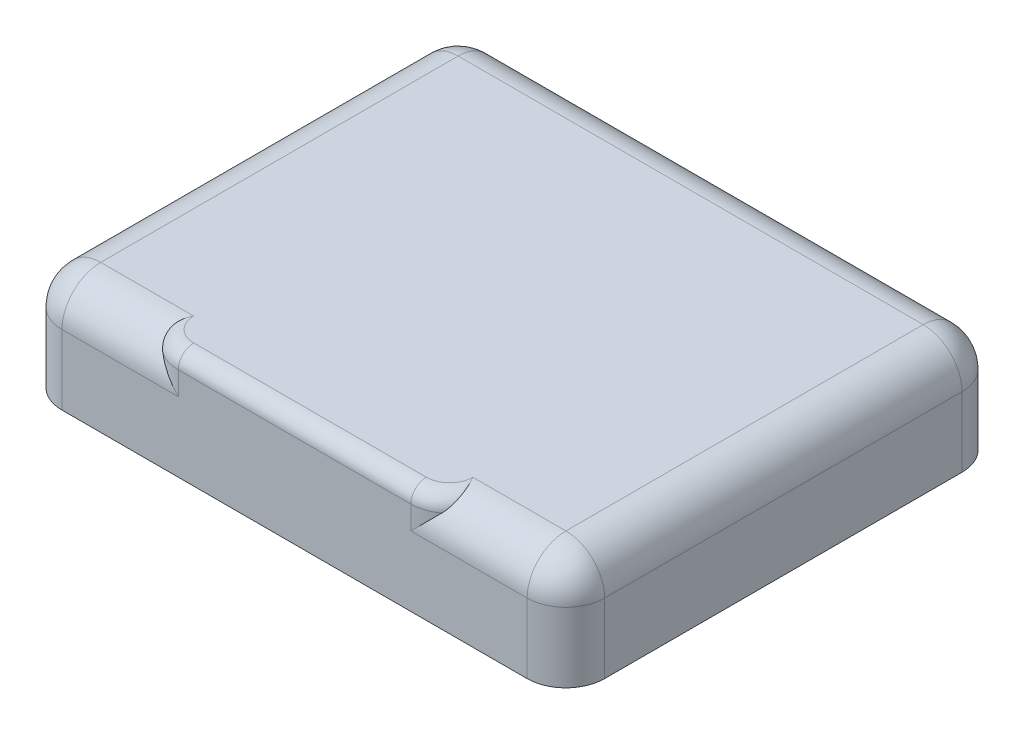
ISO-10303-21;
HEADER;
FILE_DESCRIPTION(('STEP AP214'),'2;1');
FILE_NAME('part.step','',(''),(''),'','','');
FILE_SCHEMA(('AUTOMOTIVE_DESIGN { 1 0 10303 214 1 1 1 1 }'));
ENDSEC;
DATA;
#1=APPLICATION_CONTEXT('core data for automotive mechanical design processes');
#2=APPLICATION_PROTOCOL_DEFINITION('international standard','automotive_design',2000,#1);
#3=PRODUCT_CONTEXT('',#1,'mechanical');
#4=PRODUCT('Part','Part','',(#3));
#5=PRODUCT_RELATED_PRODUCT_CATEGORY('part','',(#4));
#6=PRODUCT_DEFINITION_FORMATION('','',#4);
#7=PRODUCT_DEFINITION_CONTEXT('part definition',#1,'design');
#8=PRODUCT_DEFINITION('design','',#6,#7);
#9=PRODUCT_DEFINITION_SHAPE('','',#8);
#10=(LENGTH_UNIT() NAMED_UNIT(*) SI_UNIT(.MILLI.,.METRE.));
#11=(NAMED_UNIT(*) PLANE_ANGLE_UNIT() SI_UNIT($,.RADIAN.));
#12=(NAMED_UNIT(*) SI_UNIT($,.STERADIAN.) SOLID_ANGLE_UNIT());
#13=UNCERTAINTY_MEASURE_WITH_UNIT(LENGTH_MEASURE(1.E-05),#10,'distance_accuracy_value','');
#14=(GEOMETRIC_REPRESENTATION_CONTEXT(3) GLOBAL_UNCERTAINTY_ASSIGNED_CONTEXT((#13)) GLOBAL_UNIT_ASSIGNED_CONTEXT((#10,
#11,#12)) REPRESENTATION_CONTEXT('',''));
#15=CARTESIAN_POINT('',(0.,0.,0.));
#16=DIRECTION('',(0.,0.,1.));
#17=DIRECTION('',(1.,0.,0.));
#18=AXIS2_PLACEMENT_3D('',#15,#16,#17);
#19=CARTESIAN_POINT('',(-20.,11.9999971389771,-5.));
#20=DIRECTION('',(0.,1.,0.));
#21=DIRECTION('',(0.,0.,1.));
#22=AXIS2_PLACEMENT_3D('',#19,#20,#21);
#23=TOROIDAL_SURFACE('',#22,3.,2.);
#24=CARTESIAN_POINT('',(-20.,11.9999971389771,-2.));
#25=DIRECTION('',(1.,0.,0.));
#26=DIRECTION('',(0.,0.,-1.));
#27=AXIS2_PLACEMENT_3D('',#24,#25,#26);
#28=CIRCLE('',#27,2.);
#29=CARTESIAN_POINT('',(-20.,11.9999971389771,0.));
#30=VERTEX_POINT('',#29);
#31=CARTESIAN_POINT('',(-20.,13.9999971389771,-2.));
#32=VERTEX_POINT('',#31);
#33=EDGE_CURVE('E133',#30,#32,#28,.F.);
#34=ORIENTED_EDGE('',*,*,#33,.F.);
#35=CARTESIAN_POINT('',(-20.,11.9999971389771,-5.));
#36=DIRECTION('',(0.,-1.,0.));
#37=DIRECTION('',(0.,0.,-1.));
#38=AXIS2_PLACEMENT_3D('',#35,#36,#37);
#39=CIRCLE('',#38,5.);
#40=CARTESIAN_POINT('',(-17.0000028610229,11.9999971389771,-0.999997854234411));
#41=VERTEX_POINT('',#40);
#42=EDGE_CURVE('E169',#41,#30,#39,.T.);
#43=ORIENTED_EDGE('',*,*,#42,.F.);
#44=CARTESIAN_POINT('',(-17.0000028610229,11.9999971389771,-0.99999785423441));
#45=CARTESIAN_POINT('',(-16.9685433468448,12.0314710240786,-1.02358768529787));
#46=CARTESIAN_POINT('',(-16.9380150519812,12.063270522877,-1.04799673537902));
#47=CARTESIAN_POINT('',(-16.8762077793162,12.1302109559662,-1.10072530639158));
#48=CARTESIAN_POINT('',(-16.8451075337961,12.165395537653,-1.12919915582734));
#49=CARTESIAN_POINT('',(-16.7992746310245,12.2194929069951,-1.17428705505748));
#50=CARTESIAN_POINT('',(-16.7837096291553,12.2382937320209,-1.1901964888065));
#51=CARTESIAN_POINT('',(-16.7526582889092,12.2766802981899,-1.22318438950377));
#52=CARTESIAN_POINT('',(-16.7371977554441,12.2962685435128,-1.24028429458282));
#53=CARTESIAN_POINT('',(-16.7064504746294,12.3362016738893,-1.27570669609291));
#54=CARTESIAN_POINT('',(-16.6911907804579,12.3565480215097,-1.29405103341046));
#55=CARTESIAN_POINT('',(-16.6609465797777,12.3979644182072,-1.33201203223056));
#56=CARTESIAN_POINT('',(-16.6459903772758,12.4190348833442,-1.35165075344345));
#57=CARTESIAN_POINT('',(-16.6097346015399,12.4716196790879,-1.40149657886462));
#58=CARTESIAN_POINT('',(-16.5889732246579,12.5031242846623,-1.43210886747611));
#59=CARTESIAN_POINT('',(-16.5566372738639,12.5543339272155,-1.48326475915251));
#60=CARTESIAN_POINT('',(-16.5444916009827,12.5741183598081,-1.50337197717411));
#61=CARTESIAN_POINT('',(-16.5193498469932,12.6162909894805,-1.54697033614792));
#62=CARTESIAN_POINT('',(-16.5064681707389,12.6386612070119,-1.57054513895537));
#63=CARTESIAN_POINT('',(-16.4813797117608,12.6837728869937,-1.61904252645895));
#64=CARTESIAN_POINT('',(-16.4691996229751,12.706508619606,-1.64398425406534));
#65=CARTESIAN_POINT('',(-16.4474566874816,12.74866283634,-1.69120151837228));
#66=CARTESIAN_POINT('',(-16.4377620519291,12.768116665828,-1.71338513564617));
#67=CARTESIAN_POINT('',(-16.4141704554566,12.8172095152042,-1.77036828076625));
#68=CARTESIAN_POINT('',(-16.4008207217842,12.8466938806414,-1.8055305961112));
#69=CARTESIAN_POINT('',(-16.379842715385,12.8958591415639,-1.86589335639723));
#70=CARTESIAN_POINT('',(-16.3717295261005,12.9157264109571,-1.89077602268205));
#71=CARTESIAN_POINT('',(-16.3566719102069,12.9543704579571,-1.94014059990749));
#72=CARTESIAN_POINT('',(-16.3496950288927,12.9731601653986,-1.96460245546974));
#73=CARTESIAN_POINT('',(-16.3368139318944,13.0096663760931,-2.01304667695941));
#74=CARTESIAN_POINT('',(-16.3308785624713,13.0273962055402,-2.03701072063012));
#75=CARTESIAN_POINT('',(-16.3199865809731,13.061804947218,-2.08438819794779));
#76=CARTESIAN_POINT('',(-16.3150001922059,13.0784974374037,-2.10778497761266));
#77=CARTESIAN_POINT('',(-16.3016604954241,13.1260083920287,-2.17558896064691));
#78=CARTESIAN_POINT('',(-16.2941788221373,13.1564069378889,-2.22046718049065));
#79=CARTESIAN_POINT('',(-16.2821528346552,13.2132681772852,-2.30742155017896));
#80=CARTESIAN_POINT('',(-16.2774083590992,13.2398421561231,-2.34939796204276));
#81=CARTESIAN_POINT('',(-16.2690389827485,13.2971210268247,-2.44301228344364));
#82=CARTESIAN_POINT('',(-16.2658460252044,13.3275492504302,-2.49485921432984));
#83=CARTESIAN_POINT('',(-16.2622658342919,13.3856405379095,-2.59808487721643));
#84=CARTESIAN_POINT('',(-16.261795585949,13.413359775543,-2.64942923354107));
#85=CARTESIAN_POINT('',(-16.2633687510424,13.4661228019282,-2.75138495796764));
#86=CARTESIAN_POINT('',(-16.2653331010945,13.4912234931416,-2.80196811560525));
#87=CARTESIAN_POINT('',(-16.2714923381079,13.538861661016,-2.90217295390169));
#88=CARTESIAN_POINT('',(-16.2756124797979,13.5614559997113,-2.95177227824742));
#89=CARTESIAN_POINT('',(-16.2866240468618,13.6077358789602,-3.05794919528435));
#90=CARTESIAN_POINT('',(-16.2938048375527,13.6311849889986,-3.11460012336305));
#91=CARTESIAN_POINT('',(-16.3106233335473,13.6754366753938,-3.22730731358909));
#92=CARTESIAN_POINT('',(-16.3202120559058,13.6962808835015,-3.28335458872847));
#93=CARTESIAN_POINT('',(-16.3416495856811,13.7354337826263,-3.3946260668341));
#94=CARTESIAN_POINT('',(-16.3534503994424,13.7537841703405,-3.44984486443719));
#95=CARTESIAN_POINT('',(-16.3791073521996,13.7880694391229,-3.55926468563163));
#96=CARTESIAN_POINT('',(-16.3929170047176,13.8040457272622,-3.61346366296095));
#97=CARTESIAN_POINT('',(-16.4223898952292,13.8337143411956,-3.72068099764443));
#98=CARTESIAN_POINT('',(-16.438008463075,13.8474473553517,-3.77370040073201));
#99=CARTESIAN_POINT('',(-16.4709008384332,13.8727686935695,-3.87842644460355));
#100=CARTESIAN_POINT('',(-16.488132086623,13.8843966144515,-3.9301369041069));
#101=CARTESIAN_POINT('',(-16.5240580406777,13.9056529532533,-4.03214164108444));
#102=CARTESIAN_POINT('',(-16.542712514471,13.9153195283476,-4.0824421633787));
#103=CARTESIAN_POINT('',(-16.581300287735,13.9328018883192,-4.18155122597582));
#104=CARTESIAN_POINT('',(-16.6011958698599,13.940654086809,-4.23036805093637));
#105=CARTESIAN_POINT('',(-16.6415539965461,13.9544739744178,-4.32518638902755));
#106=CARTESIAN_POINT('',(-16.6619416736756,13.960514847534,-4.37120917508092));
#107=CARTESIAN_POINT('',(-16.7038248820348,13.9711789808222,-4.46215699224356));
#108=CARTESIAN_POINT('',(-16.7253018527507,13.9758201936233,-4.50708846490383));
#109=CARTESIAN_POINT('',(-16.7692960124853,13.9837883085311,-4.59578108921126));
#110=CARTESIAN_POINT('',(-16.791794822543,13.9871324161852,-4.63954983729247));
#111=CARTESIAN_POINT('',(-16.8376739129913,13.9926045727179,-4.72591339564861));
#112=CARTESIAN_POINT('',(-16.8610373956365,13.9947490261504,-4.76851606071834));
#113=CARTESIAN_POINT('',(-16.8965771228377,13.9971209501833,-4.83084326068552));
#114=CARTESIAN_POINT('',(-16.9082048496586,13.9977642140193,-4.850865503695));
#115=CARTESIAN_POINT('',(-16.9302501258084,13.9987395408616,-4.88793725750962));
#116=CARTESIAN_POINT('',(-16.9406146247131,13.999102206077,-4.90501746641776));
#117=CARTESIAN_POINT('',(-16.9599478709786,13.9996044885008,-4.93638397239684));
#118=CARTESIAN_POINT('',(-16.9688825212029,13.99977005165,-4.950691001917));
#119=CARTESIAN_POINT('',(-16.9852182273584,13.999956163521,-4.97666132635006));
#120=CARTESIAN_POINT('',(-16.9926039467028,13.9999975462897,-4.98833411293266));
#121=CARTESIAN_POINT('',(-17.,13.9999971389771,-5.));
#122=B_SPLINE_CURVE_WITH_KNOTS('',3,(#44,#45,#46,#47,#48,#49,#50,#51,#52,#53,#54,#55,#56,#57,
#58,#59,#60,#61,#62,#63,#64,#65,#66,#67,#68,#69,#70,#71,#72,#73,#74,#75,#76,#77,#78,#79,#80,#81,
#82,#83,#84,#85,#86,#87,#88,#89,#90,#91,#92,#93,#94,#95,#96,#97,#98,#99,#100,#101,#102,#103,
#104,#105,#106,#107,#108,#109,#110,#111,#112,#113,#114,#115,#116,#117,#118,#119,#120,#121),
.UNSPECIFIED.,.F.,.F.,(4,2,2,2,2,2,2,2,2,2,2,2,2,2,2,2,2,2,2,2,2,2,2,2,2,2,2,2,2,2,2,2,2,2,2,2,
2,2,4),(0.,0.151095063094934,0.315757256449339,0.403151585574295,0.493890362775871,
0.587948948376733,0.685298135788642,0.830990264284182,0.923114223814021,1.02796817635282,
1.13558243181744,1.22874068757294,1.37204834224142,1.47060764724025,1.56546476688188,
1.65663471249204,1.74413554487915,1.90819936346034,2.05786481910902,2.23836010672885,
2.41332189535017,2.58274776012654,2.74665449838104,2.93174677675183,3.11334201805537,
3.29137713944828,3.46580514722816,3.63659492934835,3.80373094834173,3.96721286358542,
4.12705510930018,4.27910855836224,4.42911948765722,4.57706634391681,4.72293730720016,
4.79242041217053,4.85236313138343,4.90296771930073,4.9444066598509),.UNSPECIFIED.);
#123=CARTESIAN_POINT('',(-17.,13.9999982833863,-5.));
#124=VERTEX_POINT('',#123);
#125=EDGE_CURVE('E289',#124,#41,#122,.F.);
#126=ORIENTED_EDGE('',*,*,#125,.F.);
#127=CARTESIAN_POINT('',(-20.,13.9999971389771,-5.));
#128=DIRECTION('',(0.,-1.,0.));
#129=DIRECTION('',(1.,0.,0.));
#130=AXIS2_PLACEMENT_3D('',#127,#128,#129);
#131=CIRCLE('',#130,3.);
#132=EDGE_CURVE('E276',#32,#124,#131,.F.);
#133=ORIENTED_EDGE('',*,*,#132,.F.);
#134=EDGE_LOOP('',(#34,#43,#126,#133));
#135=FACE_BOUND('',#134,.T.);
#136=ADVANCED_FACE('F16',(#135),#23,.T.);
#137=CARTESIAN_POINT('',(0.,13.9999971389771,0.));
#138=DIRECTION('',(0.,1.,0.));
#139=DIRECTION('',(0.,0.,1.));
#140=AXIS2_PLACEMENT_3D('',#137,#138,#139);
#141=PLANE('',#140);
#142=DIRECTION('',(1.,0.,0.));
#143=VECTOR('',#142,1.);
#144=CARTESIAN_POINT('',(0.,13.9999971389771,-2.));
#145=LINE('',#144,#143);
#146=CARTESIAN_POINT('',(-50.,13.9999971389771,-2.));
#147=VERTEX_POINT('',#146);
#148=EDGE_CURVE('E159',#32,#147,#145,.F.);
#149=ORIENTED_EDGE('',*,*,#148,.F.);
#150=ORIENTED_EDGE('',*,*,#132,.T.);
#151=DIRECTION('',(-1.,0.,0.));
#152=VECTOR('',#151,1.);
#153=CARTESIAN_POINT('',(0.,14.,-5.));
#154=LINE('',#153,#152);
#155=CARTESIAN_POINT('',(-5.,14.,-5.));
#156=VERTEX_POINT('',#155);
#157=EDGE_CURVE('E176',#156,#124,#154,.T.);
#158=ORIENTED_EDGE('',*,*,#157,.F.);
#159=DIRECTION('',(0.,0.,1.));
#160=VECTOR('',#159,1.);
#161=CARTESIAN_POINT('',(-5.,14.,0.));
#162=LINE('',#161,#160);
#163=CARTESIAN_POINT('',(-5.,14.,-51.1));
#164=VERTEX_POINT('',#163);
#165=EDGE_CURVE('E271',#164,#156,#162,.T.);
#166=ORIENTED_EDGE('',*,*,#165,.F.);
#167=DIRECTION('',(1.,0.,0.));
#168=VECTOR('',#167,1.);
#169=CARTESIAN_POINT('',(0.,14.,-51.1));
#170=LINE('',#169,#168);
#171=CARTESIAN_POINT('',(-65.,14.,-51.1));
#172=VERTEX_POINT('',#171);
#173=EDGE_CURVE('E228',#172,#164,#170,.T.);
#174=ORIENTED_EDGE('',*,*,#173,.F.);
#175=DIRECTION('',(0.,0.,-1.));
#176=VECTOR('',#175,1.);
#177=CARTESIAN_POINT('',(-65.,14.,0.));
#178=LINE('',#177,#176);
#179=CARTESIAN_POINT('',(-65.,14.,-5.));
#180=VERTEX_POINT('',#179);
#181=EDGE_CURVE('E183',#180,#172,#178,.T.);
#182=ORIENTED_EDGE('',*,*,#181,.F.);
#183=DIRECTION('',(-1.,0.,0.));
#184=VECTOR('',#183,1.);
#185=CARTESIAN_POINT('',(0.,14.,-5.));
#186=LINE('',#185,#184);
#187=CARTESIAN_POINT('',(-53.,13.9999982833863,-5.));
#188=VERTEX_POINT('',#187);
#189=EDGE_CURVE('E143',#188,#180,#186,.T.);
#190=ORIENTED_EDGE('',*,*,#189,.F.);
#191=CARTESIAN_POINT('',(-50.,13.9999971389771,-5.));
#192=DIRECTION('',(0.,-1.,0.));
#193=DIRECTION('',(0.,0.,1.));
#194=AXIS2_PLACEMENT_3D('',#191,#192,#193);
#195=CIRCLE('',#194,3.);
#196=EDGE_CURVE('E150',#147,#188,#195,.T.);
#197=ORIENTED_EDGE('',*,*,#196,.F.);
#198=EDGE_LOOP('',(#149,#150,#158,#166,#174,#182,#190,#197));
#199=FACE_BOUND('',#198,.T.);
#200=ADVANCED_FACE('F282',(#199),#141,.T.);
#201=CARTESIAN_POINT('',(-50.,11.9999971389771,-5.));
#202=DIRECTION('',(0.,1.,0.));
#203=DIRECTION('',(0.,0.,1.));
#204=AXIS2_PLACEMENT_3D('',#201,#202,#203);
#205=TOROIDAL_SURFACE('',#204,3.,2.);
#206=CARTESIAN_POINT('',(-50.,11.9999971389771,-2.));
#207=DIRECTION('',(1.,0.,0.));
#208=DIRECTION('',(0.,0.,-1.));
#209=AXIS2_PLACEMENT_3D('',#206,#207,#208);
#210=CIRCLE('',#209,2.);
#211=CARTESIAN_POINT('',(-50.,11.9999971389771,0.));
#212=VERTEX_POINT('',#211);
#213=EDGE_CURVE('E400',#147,#212,#210,.T.);
#214=ORIENTED_EDGE('',*,*,#213,.F.);
#215=ORIENTED_EDGE('',*,*,#196,.T.);
#216=CARTESIAN_POINT('',(-53.,13.9999971389771,-5.));
#217=CARTESIAN_POINT('',(-53.0048102848863,13.9999974414059,-4.99249277452216));
#218=CARTESIAN_POINT('',(-53.009628963525,13.9999798762573,-4.98499077345538));
#219=CARTESIAN_POINT('',(-53.0223555791129,13.9998860340252,-4.96513836500946));
#220=CARTESIAN_POINT('',(-53.0302520585178,13.9997792029166,-4.95278073372141));
#221=CARTESIAN_POINT('',(-53.0489871558561,13.9994061804621,-4.9230120620817));
#222=CARTESIAN_POINT('',(-53.0597441189394,13.9990934464615,-4.905549827236));
#223=CARTESIAN_POINT('',(-53.0767556690342,13.9984406507459,-4.87728310260136));
#224=CARTESIAN_POINT('',(-53.0831254866854,13.998159131358,-4.86654626530529));
#225=CARTESIAN_POINT('',(-53.1017924370356,13.9972240555804,-4.83472660057685));
#226=CARTESIAN_POINT('',(-53.113939012903,13.9964720019811,-4.81355840127018));
#227=CARTESIAN_POINT('',(-53.1495962285819,13.9938246466733,-4.75029848004525));
#228=CARTESIAN_POINT('',(-53.1726267510635,13.991529946883,-4.70795121727565));
#229=CARTESIAN_POINT('',(-53.2169969095942,13.9858740035311,-4.62339689426843));
#230=CARTESIAN_POINT('',(-53.2383590716988,13.9825321125189,-4.58120033212006));
#231=CARTESIAN_POINT('',(-53.2795234617379,13.9747894456212,-4.49717423611422));
#232=CARTESIAN_POINT('',(-53.2993479766405,13.9704105743746,-4.45535357500272));
#233=CARTESIAN_POINT('',(-53.3444750104283,13.958817988736,-4.3569649059978));
#234=CARTESIAN_POINT('',(-53.3693322514192,13.9511469282986,-4.30024481850378));
#235=CARTESIAN_POINT('',(-53.417468373236,13.9334539889983,-4.18470180680821));
#236=CARTESIAN_POINT('',(-53.4406881865306,13.9233753449428,-4.1258629223143));
#237=CARTESIAN_POINT('',(-53.485294777176,13.9006230477395,-4.00619726825439));
#238=CARTESIAN_POINT('',(-53.5066185328184,13.8878889652023,-3.94535847170556));
#239=CARTESIAN_POINT('',(-53.5471289987058,13.8595894636554,-3.82183634086324));
#240=CARTESIAN_POINT('',(-53.5662482105204,13.843960711123,-3.75914519869389));
#241=CARTESIAN_POINT('',(-53.5929280281532,13.8183823802827,-3.66446590310661));
#242=CARTESIAN_POINT('',(-53.6015563909468,13.8094097639826,-3.63250869746612));
#243=CARTESIAN_POINT('',(-53.6181529812583,13.7906648315275,-3.56821577850957));
#244=CARTESIAN_POINT('',(-53.6261120839141,13.7808842375062,-3.53588010741674));
#245=CARTESIAN_POINT('',(-53.6413295046257,13.7604973597668,-3.47086663681302));
#246=CARTESIAN_POINT('',(-53.6485785060146,13.7498827355436,-3.4381892739269));
#247=CARTESIAN_POINT('',(-53.6623352975665,13.7278027801922,-3.37253091135682));
#248=CARTESIAN_POINT('',(-53.6688336086412,13.7163290720712,-3.33955073969418));
#249=CARTESIAN_POINT('',(-53.6810490154414,13.6925071840223,-3.27332986956094));
#250=CARTESIAN_POINT('',(-53.6867565009702,13.6801506190381,-3.24009041373992));
#251=CARTESIAN_POINT('',(-53.697348584904,13.654541764292,-3.1733969248619));
#252=CARTESIAN_POINT('',(-53.7022234497986,13.6412811225271,-3.13994454860884));
#253=CARTESIAN_POINT('',(-53.710515202199,13.6156964641503,-3.07741360861799));
#254=CARTESIAN_POINT('',(-53.7140382222277,13.6034631181187,-3.04831193676329));
#255=CARTESIAN_POINT('',(-53.7204563034734,13.5781032192926,-2.98956688514657));
#256=CARTESIAN_POINT('',(-53.7233337150222,13.5649620714359,-2.95992786836539));
#257=CARTESIAN_POINT('',(-53.7283878759385,13.5377532586809,-2.90014211657007));
#258=CARTESIAN_POINT('',(-53.7305459345162,13.5236708509343,-2.87000050743315));
#259=CARTESIAN_POINT('',(-53.7340889907864,13.4945467383293,-2.80925002492983));
#260=CARTESIAN_POINT('',(-53.7354543478142,13.4794901726432,-2.77864712553818));
#261=CARTESIAN_POINT('',(-53.7373376107118,13.4483873756551,-2.71702069849681));
#262=CARTESIAN_POINT('',(-53.7378349602792,13.4323262373367,-2.68600406103302));
#263=CARTESIAN_POINT('',(-53.7379080541823,13.3991855517533,-2.62360400439613));
#264=CARTESIAN_POINT('',(-53.7374624131082,13.3820910996122,-2.59222847350267));
#265=CARTESIAN_POINT('',(-53.7355711520931,13.3468601568202,-2.52916964370856));
#266=CARTESIAN_POINT('',(-53.7341033012126,13.3287088863662,-2.49749525552469));
#267=CARTESIAN_POINT('',(-53.7304981250241,13.2950205305946,-2.44018276508206));
#268=CARTESIAN_POINT('',(-53.7285257970867,13.2795910459889,-2.41447080984584));
#269=CARTESIAN_POINT('',(-53.7237783622719,13.2475974930009,-2.36223321514656));
#270=CARTESIAN_POINT('',(-53.7209712895107,13.2310135470577,-2.33572263230105));
#271=CARTESIAN_POINT('',(-53.7144397041915,13.1966726321482,-2.28194605670956));
#272=CARTESIAN_POINT('',(-53.7106808278562,13.1788959263324,-2.25469683503721));
#273=CARTESIAN_POINT('',(-53.70213052975,13.1421314917451,-2.19951222772568));
#274=CARTESIAN_POINT('',(-53.6973026185009,13.1231241632329,-2.17159554325283));
#275=CARTESIAN_POINT('',(-53.6864967783281,13.083863530835,-2.11515661972862));
#276=CARTESIAN_POINT('',(-53.6804803980273,13.0635908637936,-2.08665520086829));
#277=CARTESIAN_POINT('',(-53.6671744173716,13.021772686407,-2.02913765628292));
#278=CARTESIAN_POINT('',(-53.6598444222928,13.0002083281422,-2.00014457478483));
#279=CARTESIAN_POINT('',(-53.6438041156316,12.9557686676505,-1.94175416352331));
#280=CARTESIAN_POINT('',(-53.6350523112632,12.9328745442409,-1.91238252859969));
#281=CARTESIAN_POINT('',(-53.6174300905565,12.8893516812427,-1.8577780971782));
#282=CARTESIAN_POINT('',(-53.6086934972614,12.8687714920835,-1.8324633041657));
#283=CARTESIAN_POINT('',(-53.5902210581024,12.8272804877433,-1.78236023829926));
#284=CARTESIAN_POINT('',(-53.5804827383734,12.8063689674122,-1.75757346072914));
#285=CARTESIAN_POINT('',(-53.5600338446205,12.7642276007624,-1.70857295892461));
#286=CARTESIAN_POINT('',(-53.5493211069469,12.7429971379597,-1.68436066828001));
#287=CARTESIAN_POINT('',(-53.5269354766054,12.7002463972267,-1.63654733978165));
#288=CARTESIAN_POINT('',(-53.5152606873574,12.6787256203253,-1.61294763605703));
#289=CARTESIAN_POINT('',(-53.4909720011246,12.6354159134824,-1.56640016216896));
#290=CARTESIAN_POINT('',(-53.4783564851573,12.6136265777581,-1.54345361440743));
#291=CARTESIAN_POINT('',(-53.4521978572432,12.5698149550275,-1.49824593607444));
#292=CARTESIAN_POINT('',(-53.4386533797726,12.5477923671468,-1.47598588739059));
#293=CARTESIAN_POINT('',(-53.4106886563362,12.5035042556186,-1.43220486685716));
#294=CARTESIAN_POINT('',(-53.3962673436603,12.4812384642387,-1.4106848471832));
#295=CARTESIAN_POINT('',(-53.366240390712,12.4362954572998,-1.36804596990597));
#296=CARTESIAN_POINT('',(-53.3506197166737,12.4136172685269,-1.34693870696931));
#297=CARTESIAN_POINT('',(-53.3184151781202,12.3685046953311,-1.30556361654428));
#298=CARTESIAN_POINT('',(-53.3018378059965,12.3460696685949,-1.28529143593045));
#299=CARTESIAN_POINT('',(-53.2678053107354,12.3014401174971,-1.24561065648349));
#300=CARTESIAN_POINT('',(-53.2503564546759,12.2792449716103,-1.22619737746834));
#301=CARTESIAN_POINT('',(-53.2146273744779,12.2351357474643,-1.18823434585186));
#302=CARTESIAN_POINT('',(-53.1963534103432,12.2132207811273,-1.16967973224305));
#303=CARTESIAN_POINT('',(-53.1590302956751,12.1696976809958,-1.13343684208868));
#304=CARTESIAN_POINT('',(-53.1399873106165,12.1480884737165,-1.11574350296431));
#305=CARTESIAN_POINT('',(-53.1011789222058,12.1052035693168,-1.08122195401543));
#306=CARTESIAN_POINT('',(-53.0814195880616,12.0839265941382,-1.06438850602225));
#307=CARTESIAN_POINT('',(-53.0412310880153,12.0417294321276,-1.03158304306721));
#308=CARTESIAN_POINT('',(-53.0208078717996,12.0208077742577,-1.01560563224194));
#309=CARTESIAN_POINT('',(-52.9999971389771,11.9999971389771,-0.999997854234411));
#310=B_SPLINE_CURVE_WITH_KNOTS('',3,(#216,#217,#218,#219,#220,#221,#222,#223,#224,#225,#226,
#227,#228,#229,#230,#231,#232,#233,#234,#235,#236,#237,#238,#239,#240,#241,#242,#243,#244,#245,
#246,#247,#248,#249,#250,#251,#252,#253,#254,#255,#256,#257,#258,#259,#260,#261,#262,#263,#264,
#265,#266,#267,#268,#269,#270,#271,#272,#273,#274,#275,#276,#277,#278,#279,#280,#281,#282,#283,
#284,#285,#286,#287,#288,#289,#290,#291,#292,#293,#294,#295,#296,#297,#298,#299,#300,#301,#302,
#303,#304,#305,#306,#307,#308,#309),.UNSPECIFIED.,.F.,.F.,(4,2,2,2,2,2,2,2,2,2,2,2,2,2,2,2,2,2,
2,2,2,2,2,2,2,2,2,2,2,2,2,2,2,2,2,2,2,2,2,2,2,2,2,2,2,2,4),(0.,0.0267486290963074,
0.0707444622110812,0.13227418845924,0.169735360093015,0.242982213707374,0.387723377635253,
0.529933428806329,0.669372102470349,0.856498814527066,1.04857048158095,1.24561490626789,
1.44763119575603,1.55050679188017,1.65461223746139,1.75993899797061,1.86647660773851,
1.97421266011424,2.08313280330983,2.17841272019956,2.2760448304012,2.37604540632759,
2.47842821158651,2.58320434000998,2.69038204235982,2.79996654232123,2.89010723291671,
2.98428045804002,3.08251764864692,3.18484704205146,3.29129313527465,3.40187608388976,
3.51661105080258,3.6179145089503,3.71947444285748,3.82126566347516,3.92326258887389,
4.0254392920053,4.12776954899382,4.23022688787913,4.33429204121207,4.43771917986614,
4.54048718889144,4.64257568040881,4.74396506607692,4.84463662205088,4.94457254677197),.UNSPECIFIED.);
#311=CARTESIAN_POINT('',(-52.9999971389771,11.9999971389771,-0.999997854234411));
#312=VERTEX_POINT('',#311);
#313=EDGE_CURVE('E146',#312,#188,#310,.F.);
#314=ORIENTED_EDGE('',*,*,#313,.F.);
#315=CARTESIAN_POINT('',(-50.,11.9999971389771,-5.));
#316=DIRECTION('',(0.,-1.,0.));
#317=DIRECTION('',(0.,0.,-1.));
#318=AXIS2_PLACEMENT_3D('',#315,#316,#317);
#319=CIRCLE('',#318,5.);
#320=EDGE_CURVE('E136',#212,#312,#319,.T.);
#321=ORIENTED_EDGE('',*,*,#320,.F.);
#322=EDGE_LOOP('',(#214,#215,#314,#321));
#323=FACE_BOUND('',#322,.T.);
#324=ADVANCED_FACE('F148',(#323),#205,.T.);
#325=CARTESIAN_POINT('',(-5.,9.,-5.));
#326=DIRECTION('',(1.,0.,0.));
#327=DIRECTION('',(0.,1.,0.));
#328=AXIS2_PLACEMENT_3D('',#325,#326,#327);
#329=SPHERICAL_SURFACE('',#328,5.);
#330=CARTESIAN_POINT('',(-5.,9.,-5.));
#331=DIRECTION('',(0.,0.,1.));
#332=DIRECTION('',(1.,0.,0.));
#333=AXIS2_PLACEMENT_3D('',#330,#331,#332);
#334=CIRCLE('',#333,5.);
#335=CARTESIAN_POINT('',(0.,9.,-5.));
#336=VERTEX_POINT('',#335);
#337=EDGE_CURVE('E270',#156,#336,#334,.F.);
#338=ORIENTED_EDGE('',*,*,#337,.F.);
#339=CARTESIAN_POINT('',(-5.,9.,-5.));
#340=DIRECTION('',(-1.,0.,0.));
#341=DIRECTION('',(0.,0.,1.));
#342=AXIS2_PLACEMENT_3D('',#339,#340,#341);
#343=CIRCLE('',#342,5.);
#344=CARTESIAN_POINT('',(-5.,9.,0.));
#345=VERTEX_POINT('',#344);
#346=EDGE_CURVE('E168',#345,#156,#343,.T.);
#347=ORIENTED_EDGE('',*,*,#346,.F.);
#348=CARTESIAN_POINT('',(-5.,9.,-5.));
#349=DIRECTION('',(0.,-1.,0.));
#350=DIRECTION('',(0.,0.,-1.));
#351=AXIS2_PLACEMENT_3D('',#348,#349,#350);
#352=CIRCLE('',#351,5.);
#353=EDGE_CURVE('E386',#336,#345,#352,.T.);
#354=ORIENTED_EDGE('',*,*,#353,.F.);
#355=EDGE_LOOP('',(#338,#347,#354));
#356=FACE_BOUND('',#355,.T.);
#357=ADVANCED_FACE('F258',(#356),#329,.T.);
#358=CARTESIAN_POINT('',(-5.,9.,0.));
#359=DIRECTION('',(0.,0.,1.));
#360=DIRECTION('',(1.,0.,0.));
#361=AXIS2_PLACEMENT_3D('',#358,#359,#360);
#362=CYLINDRICAL_SURFACE('',#361,5.);
#363=CARTESIAN_POINT('',(-5.,9.,-51.1));
#364=DIRECTION('',(0.,0.,1.));
#365=DIRECTION('',(1.,0.,0.));
#366=AXIS2_PLACEMENT_3D('',#363,#364,#365);
#367=CIRCLE('',#366,5.);
#368=CARTESIAN_POINT('',(0.,9.,-51.1));
#369=VERTEX_POINT('',#368);
#370=EDGE_CURVE('E233',#164,#369,#367,.F.);
#371=ORIENTED_EDGE('',*,*,#370,.F.);
#372=ORIENTED_EDGE('',*,*,#165,.T.);
#373=ORIENTED_EDGE('',*,*,#337,.T.);
#374=DIRECTION('',(0.,0.,1.));
#375=VECTOR('',#374,1.);
#376=CARTESIAN_POINT('',(0.,9.,0.));
#377=LINE('',#376,#375);
#378=EDGE_CURVE('E240',#336,#369,#377,.F.);
#379=ORIENTED_EDGE('',*,*,#378,.T.);
#380=EDGE_LOOP('',(#371,#372,#373,#379));
#381=FACE_BOUND('',#380,.T.);
#382=ADVANCED_FACE('F254',(#381),#362,.T.);
#383=CARTESIAN_POINT('',(-5.,9.,-51.1));
#384=DIRECTION('',(1.,0.,0.));
#385=DIRECTION('',(0.,1.,0.));
#386=AXIS2_PLACEMENT_3D('',#383,#384,#385);
#387=SPHERICAL_SURFACE('',#386,5.);
#388=CARTESIAN_POINT('',(-5.,9.,-51.1));
#389=DIRECTION('',(1.,0.,0.));
#390=DIRECTION('',(0.,0.,-1.));
#391=AXIS2_PLACEMENT_3D('',#388,#389,#390);
#392=CIRCLE('',#391,5.);
#393=CARTESIAN_POINT('',(-5.,9.,-56.1));
#394=VERTEX_POINT('',#393);
#395=EDGE_CURVE('E231',#164,#394,#392,.F.);
#396=ORIENTED_EDGE('',*,*,#395,.F.);
#397=ORIENTED_EDGE('',*,*,#370,.T.);
#398=CARTESIAN_POINT('',(-5.,9.,-51.1));
#399=DIRECTION('',(0.,-1.,0.));
#400=DIRECTION('',(0.,0.,-1.));
#401=AXIS2_PLACEMENT_3D('',#398,#399,#400);
#402=CIRCLE('',#401,5.);
#403=EDGE_CURVE('E236',#394,#369,#402,.T.);
#404=ORIENTED_EDGE('',*,*,#403,.F.);
#405=EDGE_LOOP('',(#396,#397,#404));
#406=FACE_BOUND('',#405,.T.);
#407=ADVANCED_FACE('F251',(#406),#387,.T.);
#408=CARTESIAN_POINT('',(0.,9.,-51.1));
#409=DIRECTION('',(1.,0.,0.));
#410=DIRECTION('',(0.,0.,-1.));
#411=AXIS2_PLACEMENT_3D('',#408,#409,#410);
#412=CYLINDRICAL_SURFACE('',#411,5.);
#413=CARTESIAN_POINT('',(-65.,9.,-51.1));
#414=DIRECTION('',(1.,0.,0.));
#415=DIRECTION('',(0.,1.,0.));
#416=AXIS2_PLACEMENT_3D('',#413,#414,#415);
#417=CIRCLE('',#416,5.);
#418=CARTESIAN_POINT('',(-65.,9.,-56.1));
#419=VERTEX_POINT('',#418);
#420=EDGE_CURVE('E225',#172,#419,#417,.F.);
#421=ORIENTED_EDGE('',*,*,#420,.F.);
#422=ORIENTED_EDGE('',*,*,#173,.T.);
#423=ORIENTED_EDGE('',*,*,#395,.T.);
#424=DIRECTION('',(1.,0.,0.));
#425=VECTOR('',#424,1.);
#426=CARTESIAN_POINT('',(0.,9.,-56.1));
#427=LINE('',#426,#425);
#428=EDGE_CURVE('E378',#394,#419,#427,.F.);
#429=ORIENTED_EDGE('',*,*,#428,.T.);
#430=EDGE_LOOP('',(#421,#422,#423,#429));
#431=FACE_BOUND('',#430,.T.);
#432=ADVANCED_FACE('F217',(#431),#412,.T.);
#433=CARTESIAN_POINT('',(-65.,9.,-51.1));
#434=DIRECTION('',(1.,0.,0.));
#435=DIRECTION('',(0.,1.,0.));
#436=AXIS2_PLACEMENT_3D('',#433,#434,#435);
#437=SPHERICAL_SURFACE('',#436,5.);
#438=CARTESIAN_POINT('',(-65.,9.,-51.1));
#439=DIRECTION('',(0.,0.,-1.));
#440=DIRECTION('',(-1.,0.,0.));
#441=AXIS2_PLACEMENT_3D('',#438,#439,#440);
#442=CIRCLE('',#441,5.);
#443=CARTESIAN_POINT('',(-70.,9.,-51.1));
#444=VERTEX_POINT('',#443);
#445=EDGE_CURVE('E227',#172,#444,#442,.F.);
#446=ORIENTED_EDGE('',*,*,#445,.F.);
#447=ORIENTED_EDGE('',*,*,#420,.T.);
#448=CARTESIAN_POINT('',(-65.,9.,-51.1));
#449=DIRECTION('',(0.,-1.,0.));
#450=DIRECTION('',(0.,0.,-1.));
#451=AXIS2_PLACEMENT_3D('',#448,#449,#450);
#452=CIRCLE('',#451,5.);
#453=EDGE_CURVE('E373',#444,#419,#452,.T.);
#454=ORIENTED_EDGE('',*,*,#453,.F.);
#455=EDGE_LOOP('',(#446,#447,#454));
#456=FACE_BOUND('',#455,.T.);
#457=ADVANCED_FACE('F212',(#456),#437,.T.);
#458=CARTESIAN_POINT('',(-65.,9.,0.));
#459=DIRECTION('',(0.,0.,-1.));
#460=DIRECTION('',(-1.,0.,0.));
#461=AXIS2_PLACEMENT_3D('',#458,#459,#460);
#462=CYLINDRICAL_SURFACE('',#461,5.);
#463=CARTESIAN_POINT('',(-65.,9.,-5.));
#464=DIRECTION('',(0.,0.,1.));
#465=DIRECTION('',(1.,0.,0.));
#466=AXIS2_PLACEMENT_3D('',#463,#464,#465);
#467=CIRCLE('',#466,5.);
#468=CARTESIAN_POINT('',(-70.,9.,-5.));
#469=VERTEX_POINT('',#468);
#470=EDGE_CURVE('E178',#180,#469,#467,.T.);
#471=ORIENTED_EDGE('',*,*,#470,.F.);
#472=ORIENTED_EDGE('',*,*,#181,.T.);
#473=ORIENTED_EDGE('',*,*,#445,.T.);
#474=DIRECTION('',(0.,0.,-1.));
#475=VECTOR('',#474,1.);
#476=CARTESIAN_POINT('',(-70.,9.,0.));
#477=LINE('',#476,#475);
#478=EDGE_CURVE('E192',#444,#469,#477,.F.);
#479=ORIENTED_EDGE('',*,*,#478,.T.);
#480=EDGE_LOOP('',(#471,#472,#473,#479));
#481=FACE_BOUND('',#480,.T.);
#482=ADVANCED_FACE('F207',(#481),#462,.T.);
#483=CARTESIAN_POINT('',(-65.,9.,-5.));
#484=DIRECTION('',(1.,0.,0.));
#485=DIRECTION('',(0.,1.,0.));
#486=AXIS2_PLACEMENT_3D('',#483,#484,#485);
#487=SPHERICAL_SURFACE('',#486,5.);
#488=CARTESIAN_POINT('',(-65.,9.,-5.));
#489=DIRECTION('',(-1.,0.,0.));
#490=DIRECTION('',(0.,0.,1.));
#491=AXIS2_PLACEMENT_3D('',#488,#489,#490);
#492=CIRCLE('',#491,5.);
#493=CARTESIAN_POINT('',(-65.,9.,0.));
#494=VERTEX_POINT('',#493);
#495=EDGE_CURVE('E77',#180,#494,#492,.F.);
#496=ORIENTED_EDGE('',*,*,#495,.F.);
#497=ORIENTED_EDGE('',*,*,#470,.T.);
#498=CARTESIAN_POINT('',(-65.,9.,-5.));
#499=DIRECTION('',(0.,-1.,0.));
#500=DIRECTION('',(0.,0.,-1.));
#501=AXIS2_PLACEMENT_3D('',#498,#499,#500);
#502=CIRCLE('',#501,5.);
#503=EDGE_CURVE('E195',#494,#469,#502,.T.);
#504=ORIENTED_EDGE('',*,*,#503,.F.);
#505=EDGE_LOOP('',(#496,#497,#504));
#506=FACE_BOUND('',#505,.T.);
#507=ADVANCED_FACE('F202',(#506),#487,.T.);
#508=CARTESIAN_POINT('',(-20.,52.,-5.));
#509=DIRECTION('',(0.,-1.,0.));
#510=DIRECTION('',(0.,0.,-1.));
#511=AXIS2_PLACEMENT_3D('',#508,#509,#510);
#512=CYLINDRICAL_SURFACE('',#511,5.);
#513=DIRECTION('',(0.,1.,0.));
#514=VECTOR('',#513,1.);
#515=CARTESIAN_POINT('',(-20.,14.,0.));
#516=LINE('',#515,#514);
#517=CARTESIAN_POINT('',(-20.,9.,0.));
#518=VERTEX_POINT('',#517);
#519=EDGE_CURVE('E364',#30,#518,#516,.F.);
#520=ORIENTED_EDGE('',*,*,#519,.T.);
#521=CARTESIAN_POINT('',(-20.,9.,-5.));
#522=DIRECTION('',(0.707106781186547,-0.707106781186547,0.));
#523=DIRECTION('',(-0.707106781186547,-0.707106781186547,0.));
#524=AXIS2_PLACEMENT_3D('',#521,#522,#523);
#525=ELLIPSE('',#524,7.07106781186547,5.);
#526=EDGE_CURVE('E166',#41,#518,#525,.T.);
#527=ORIENTED_EDGE('',*,*,#526,.F.);
#528=ORIENTED_EDGE('',*,*,#42,.T.);
#529=EDGE_LOOP('',(#520,#527,#528));
#530=FACE_BOUND('',#529,.T.);
#531=ADVANCED_FACE('F206',(#530),#512,.T.);
#532=CARTESIAN_POINT('',(0.,9.,-5.));
#533=DIRECTION('',(-1.,0.,0.));
#534=DIRECTION('',(0.,0.,1.));
#535=AXIS2_PLACEMENT_3D('',#532,#533,#534);
#536=CYLINDRICAL_SURFACE('',#535,5.);
#537=ORIENTED_EDGE('',*,*,#157,.T.);
#538=ORIENTED_EDGE('',*,*,#125,.T.);
#539=ORIENTED_EDGE('',*,*,#526,.T.);
#540=DIRECTION('',(-1.,0.,0.));
#541=VECTOR('',#540,1.);
#542=CARTESIAN_POINT('',(0.,9.,0.));
#543=LINE('',#542,#541);
#544=EDGE_CURVE('E359',#518,#345,#543,.F.);
#545=ORIENTED_EDGE('',*,*,#544,.T.);
#546=ORIENTED_EDGE('',*,*,#346,.T.);
#547=EDGE_LOOP('',(#537,#538,#539,#545,#546));
#548=FACE_BOUND('',#547,.T.);
#549=ADVANCED_FACE('F288',(#548),#536,.T.);
#550=CARTESIAN_POINT('',(0.,9.,-5.));
#551=DIRECTION('',(-1.,0.,0.));
#552=DIRECTION('',(0.,0.,1.));
#553=AXIS2_PLACEMENT_3D('',#550,#551,#552);
#554=CYLINDRICAL_SURFACE('',#553,5.);
#555=ORIENTED_EDGE('',*,*,#313,.T.);
#556=ORIENTED_EDGE('',*,*,#189,.T.);
#557=ORIENTED_EDGE('',*,*,#495,.T.);
#558=DIRECTION('',(-1.,0.,0.));
#559=VECTOR('',#558,1.);
#560=CARTESIAN_POINT('',(0.,9.,0.));
#561=LINE('',#560,#559);
#562=CARTESIAN_POINT('',(-50.,9.,0.));
#563=VERTEX_POINT('',#562);
#564=EDGE_CURVE('E157',#494,#563,#561,.F.);
#565=ORIENTED_EDGE('',*,*,#564,.T.);
#566=CARTESIAN_POINT('',(-50.,9.,-5.));
#567=DIRECTION('',(-0.707106781186547,-0.707106781186547,0.));
#568=DIRECTION('',(-0.707106781186547,0.707106781186547,0.));
#569=AXIS2_PLACEMENT_3D('',#566,#567,#568);
#570=ELLIPSE('',#569,7.07106781186547,5.);
#571=EDGE_CURVE('E66',#312,#563,#570,.F.);
#572=ORIENTED_EDGE('',*,*,#571,.F.);
#573=EDGE_LOOP('',(#555,#556,#557,#565,#572));
#574=FACE_BOUND('',#573,.T.);
#575=ADVANCED_FACE('F156',(#574),#554,.T.);
#576=CARTESIAN_POINT('',(-50.,14.,-5.));
#577=DIRECTION('',(0.,-1.,0.));
#578=DIRECTION('',(0.,0.,-1.));
#579=AXIS2_PLACEMENT_3D('',#576,#577,#578);
#580=CYLINDRICAL_SURFACE('',#579,5.);
#581=ORIENTED_EDGE('',*,*,#571,.T.);
#582=DIRECTION('',(0.,1.,0.));
#583=VECTOR('',#582,1.);
#584=CARTESIAN_POINT('',(-50.,14.,0.));
#585=LINE('',#584,#583);
#586=EDGE_CURVE('E139',#563,#212,#585,.T.);
#587=ORIENTED_EDGE('',*,*,#586,.T.);
#588=ORIENTED_EDGE('',*,*,#320,.T.);
#589=EDGE_LOOP('',(#581,#587,#588));
#590=FACE_BOUND('',#589,.T.);
#591=ADVANCED_FACE('F138',(#590),#580,.T.);
#592=CARTESIAN_POINT('',(0.,11.9999971389771,-2.));
#593=DIRECTION('',(1.,0.,0.));
#594=DIRECTION('',(0.,0.,-1.));
#595=AXIS2_PLACEMENT_3D('',#592,#593,#594);
#596=CYLINDRICAL_SURFACE('',#595,2.);
#597=ORIENTED_EDGE('',*,*,#213,.T.);
#598=DIRECTION('',(-1.,0.,0.));
#599=VECTOR('',#598,1.);
#600=CARTESIAN_POINT('',(0.,11.9999971389771,0.));
#601=LINE('',#600,#599);
#602=EDGE_CURVE('E350',#212,#30,#601,.F.);
#603=ORIENTED_EDGE('',*,*,#602,.T.);
#604=ORIENTED_EDGE('',*,*,#33,.T.);
#605=ORIENTED_EDGE('',*,*,#148,.T.);
#606=EDGE_LOOP('',(#597,#603,#604,#605));
#607=FACE_BOUND('',#606,.T.);
#608=ADVANCED_FACE('F498',(#607),#596,.T.);
#609=CARTESIAN_POINT('',(-5.,14.,-5.));
#610=DIRECTION('',(0.,-1.,0.));
#611=DIRECTION('',(0.,0.,-1.));
#612=AXIS2_PLACEMENT_3D('',#609,#610,#611);
#613=CYLINDRICAL_SURFACE('',#612,5.);
#614=DIRECTION('',(0.,1.,0.));
#615=VECTOR('',#614,1.);
#616=CARTESIAN_POINT('',(-5.,14.,0.));
#617=LINE('',#616,#615);
#618=CARTESIAN_POINT('',(-5.,0.,0.));
#619=VERTEX_POINT('',#618);
#620=EDGE_CURVE('E354',#345,#619,#617,.F.);
#621=ORIENTED_EDGE('',*,*,#620,.T.);
#622=CARTESIAN_POINT('',(-5.,0.,-5.));
#623=DIRECTION('',(0.,-1.,0.));
#624=DIRECTION('',(0.,0.,-1.));
#625=AXIS2_PLACEMENT_3D('',#622,#623,#624);
#626=CIRCLE('',#625,5.);
#627=CARTESIAN_POINT('',(0.,0.,-5.));
#628=VERTEX_POINT('',#627);
#629=EDGE_CURVE('E163',#619,#628,#626,.F.);
#630=ORIENTED_EDGE('',*,*,#629,.T.);
#631=DIRECTION('',(0.,1.,0.));
#632=VECTOR('',#631,1.);
#633=CARTESIAN_POINT('',(0.,14.,-5.));
#634=LINE('',#633,#632);
#635=EDGE_CURVE('E245',#628,#336,#634,.T.);
#636=ORIENTED_EDGE('',*,*,#635,.T.);
#637=ORIENTED_EDGE('',*,*,#353,.T.);
#638=EDGE_LOOP('',(#621,#630,#636,#637));
#639=FACE_BOUND('',#638,.T.);
#640=ADVANCED_FACE('F472',(#639),#613,.T.);
#641=CARTESIAN_POINT('',(0.,14.,0.));
#642=DIRECTION('',(-1.,0.,0.));
#643=DIRECTION('',(0.,0.,1.));
#644=AXIS2_PLACEMENT_3D('',#641,#642,#643);
#645=PLANE('',#644);
#646=ORIENTED_EDGE('',*,*,#378,.F.);
#647=ORIENTED_EDGE('',*,*,#635,.F.);
#648=DIRECTION('',(0.,0.,1.));
#649=VECTOR('',#648,1.);
#650=CARTESIAN_POINT('',(0.,0.,0.));
#651=LINE('',#650,#649);
#652=CARTESIAN_POINT('',(0.,0.,-51.1));
#653=VERTEX_POINT('',#652);
#654=EDGE_CURVE('E338',#628,#653,#651,.F.);
#655=ORIENTED_EDGE('',*,*,#654,.T.);
#656=DIRECTION('',(0.,-1.,0.));
#657=VECTOR('',#656,1.);
#658=CARTESIAN_POINT('',(0.,14.,-51.1));
#659=LINE('',#658,#657);
#660=EDGE_CURVE('E239',#369,#653,#659,.T.);
#661=ORIENTED_EDGE('',*,*,#660,.F.);
#662=EDGE_LOOP('',(#646,#647,#655,#661));
#663=FACE_BOUND('',#662,.T.);
#664=ADVANCED_FACE('F494',(#663),#645,.F.);
#665=CARTESIAN_POINT('',(-5.,14.,-51.1));
#666=DIRECTION('',(0.,-1.,0.));
#667=DIRECTION('',(0.,0.,-1.));
#668=AXIS2_PLACEMENT_3D('',#665,#666,#667);
#669=CYLINDRICAL_SURFACE('',#668,5.);
#670=ORIENTED_EDGE('',*,*,#660,.T.);
#671=CARTESIAN_POINT('',(-5.,0.,-51.1));
#672=DIRECTION('',(0.,-1.,0.));
#673=DIRECTION('',(0.,0.,-1.));
#674=AXIS2_PLACEMENT_3D('',#671,#672,#673);
#675=CIRCLE('',#674,5.);
#676=CARTESIAN_POINT('',(-5.,0.,-56.1));
#677=VERTEX_POINT('',#676);
#678=EDGE_CURVE('E336',#653,#677,#675,.F.);
#679=ORIENTED_EDGE('',*,*,#678,.T.);
#680=DIRECTION('',(0.,1.,0.));
#681=VECTOR('',#680,1.);
#682=CARTESIAN_POINT('',(-5.,14.,-56.1));
#683=LINE('',#682,#681);
#684=EDGE_CURVE('E376',#677,#394,#683,.T.);
#685=ORIENTED_EDGE('',*,*,#684,.T.);
#686=ORIENTED_EDGE('',*,*,#403,.T.);
#687=EDGE_LOOP('',(#670,#679,#685,#686));
#688=FACE_BOUND('',#687,.T.);
#689=ADVANCED_FACE('F491',(#688),#669,.T.);
#690=CARTESIAN_POINT('',(0.,14.,-56.1));
#691=DIRECTION('',(0.,0.,1.));
#692=DIRECTION('',(1.,0.,0.));
#693=AXIS2_PLACEMENT_3D('',#690,#691,#692);
#694=PLANE('',#693);
#695=ORIENTED_EDGE('',*,*,#428,.F.);
#696=ORIENTED_EDGE('',*,*,#684,.F.);
#697=DIRECTION('',(1.,0.,0.));
#698=VECTOR('',#697,1.);
#699=CARTESIAN_POINT('',(0.,0.,-56.1));
#700=LINE('',#699,#698);
#701=CARTESIAN_POINT('',(-65.,0.,-56.1));
#702=VERTEX_POINT('',#701);
#703=EDGE_CURVE('E335',#677,#702,#700,.F.);
#704=ORIENTED_EDGE('',*,*,#703,.T.);
#705=DIRECTION('',(0.,-1.,0.));
#706=VECTOR('',#705,1.);
#707=CARTESIAN_POINT('',(-65.,14.,-56.1));
#708=LINE('',#707,#706);
#709=EDGE_CURVE('E369',#419,#702,#708,.T.);
#710=ORIENTED_EDGE('',*,*,#709,.F.);
#711=EDGE_LOOP('',(#695,#696,#704,#710));
#712=FACE_BOUND('',#711,.T.);
#713=ADVANCED_FACE('F470',(#712),#694,.F.);
#714=CARTESIAN_POINT('',(-65.,14.,-51.1));
#715=DIRECTION('',(0.,-1.,0.));
#716=DIRECTION('',(0.,0.,-1.));
#717=AXIS2_PLACEMENT_3D('',#714,#715,#716);
#718=CYLINDRICAL_SURFACE('',#717,5.);
#719=ORIENTED_EDGE('',*,*,#709,.T.);
#720=CARTESIAN_POINT('',(-65.,0.,-51.1));
#721=DIRECTION('',(0.,-1.,0.));
#722=DIRECTION('',(0.,0.,-1.));
#723=AXIS2_PLACEMENT_3D('',#720,#721,#722);
#724=CIRCLE('',#723,5.);
#725=CARTESIAN_POINT('',(-70.,0.,-51.1));
#726=VERTEX_POINT('',#725);
#727=EDGE_CURVE('E333',#702,#726,#724,.F.);
#728=ORIENTED_EDGE('',*,*,#727,.T.);
#729=DIRECTION('',(0.,1.,0.));
#730=VECTOR('',#729,1.);
#731=CARTESIAN_POINT('',(-70.,14.,-51.1));
#732=LINE('',#731,#730);
#733=EDGE_CURVE('E196',#726,#444,#732,.T.);
#734=ORIENTED_EDGE('',*,*,#733,.T.);
#735=ORIENTED_EDGE('',*,*,#453,.T.);
#736=EDGE_LOOP('',(#719,#728,#734,#735));
#737=FACE_BOUND('',#736,.T.);
#738=ADVANCED_FACE('F464',(#737),#718,.T.);
#739=CARTESIAN_POINT('',(-70.,14.,0.));
#740=DIRECTION('',(1.,0.,0.));
#741=DIRECTION('',(0.,0.,-1.));
#742=AXIS2_PLACEMENT_3D('',#739,#740,#741);
#743=PLANE('',#742);
#744=ORIENTED_EDGE('',*,*,#478,.F.);
#745=ORIENTED_EDGE('',*,*,#733,.F.);
#746=DIRECTION('',(0.,0.,1.));
#747=VECTOR('',#746,1.);
#748=CARTESIAN_POINT('',(-70.,0.,0.));
#749=LINE('',#748,#747);
#750=CARTESIAN_POINT('',(-70.,0.,-5.));
#751=VERTEX_POINT('',#750);
#752=EDGE_CURVE('E332',#726,#751,#749,.T.);
#753=ORIENTED_EDGE('',*,*,#752,.T.);
#754=DIRECTION('',(0.,-1.,0.));
#755=VECTOR('',#754,1.);
#756=CARTESIAN_POINT('',(-70.,14.,-5.));
#757=LINE('',#756,#755);
#758=EDGE_CURVE('E362',#469,#751,#757,.T.);
#759=ORIENTED_EDGE('',*,*,#758,.F.);
#760=EDGE_LOOP('',(#744,#745,#753,#759));
#761=FACE_BOUND('',#760,.T.);
#762=ADVANCED_FACE('F457',(#761),#743,.F.);
#763=CARTESIAN_POINT('',(-65.,14.,-5.));
#764=DIRECTION('',(0.,-1.,0.));
#765=DIRECTION('',(0.,0.,-1.));
#766=AXIS2_PLACEMENT_3D('',#763,#764,#765);
#767=CYLINDRICAL_SURFACE('',#766,5.);
#768=ORIENTED_EDGE('',*,*,#758,.T.);
#769=CARTESIAN_POINT('',(-65.,0.,-5.));
#770=DIRECTION('',(0.,-1.,0.));
#771=DIRECTION('',(0.,0.,-1.));
#772=AXIS2_PLACEMENT_3D('',#769,#770,#771);
#773=CIRCLE('',#772,5.);
#774=CARTESIAN_POINT('',(-65.,0.,0.));
#775=VERTEX_POINT('',#774);
#776=EDGE_CURVE('E27',#751,#775,#773,.F.);
#777=ORIENTED_EDGE('',*,*,#776,.T.);
#778=DIRECTION('',(0.,1.,0.));
#779=VECTOR('',#778,1.);
#780=CARTESIAN_POINT('',(-65.,14.,0.));
#781=LINE('',#780,#779);
#782=EDGE_CURVE('E35',#775,#494,#781,.T.);
#783=ORIENTED_EDGE('',*,*,#782,.T.);
#784=ORIENTED_EDGE('',*,*,#503,.T.);
#785=EDGE_LOOP('',(#768,#777,#783,#784));
#786=FACE_BOUND('',#785,.T.);
#787=ADVANCED_FACE('F448',(#786),#767,.T.);
#788=CARTESIAN_POINT('',(0.,14.,0.));
#789=DIRECTION('',(0.,0.,-1.));
#790=DIRECTION('',(-1.,0.,0.));
#791=AXIS2_PLACEMENT_3D('',#788,#789,#790);
#792=PLANE('',#791);
#793=ORIENTED_EDGE('',*,*,#586,.F.);
#794=ORIENTED_EDGE('',*,*,#564,.F.);
#795=ORIENTED_EDGE('',*,*,#782,.F.);
#796=DIRECTION('',(1.,0.,0.));
#797=VECTOR('',#796,1.);
#798=CARTESIAN_POINT('',(0.,0.,0.));
#799=LINE('',#798,#797);
#800=EDGE_CURVE('E11',#775,#619,#799,.T.);
#801=ORIENTED_EDGE('',*,*,#800,.T.);
#802=ORIENTED_EDGE('',*,*,#620,.F.);
#803=ORIENTED_EDGE('',*,*,#544,.F.);
#804=ORIENTED_EDGE('',*,*,#519,.F.);
#805=ORIENTED_EDGE('',*,*,#602,.F.);
#806=EDGE_LOOP('',(#793,#794,#795,#801,#802,#803,#804,#805));
#807=FACE_BOUND('',#806,.T.);
#808=ADVANCED_FACE('F474',(#807),#792,.F.);
#809=CARTESIAN_POINT('',(0.,0.,0.));
#810=DIRECTION('',(0.,1.,0.));
#811=DIRECTION('',(0.,0.,1.));
#812=AXIS2_PLACEMENT_3D('',#809,#810,#811);
#813=PLANE('',#812);
#814=ORIENTED_EDGE('',*,*,#776,.F.);
#815=ORIENTED_EDGE('',*,*,#752,.F.);
#816=ORIENTED_EDGE('',*,*,#727,.F.);
#817=ORIENTED_EDGE('',*,*,#703,.F.);
#818=ORIENTED_EDGE('',*,*,#678,.F.);
#819=ORIENTED_EDGE('',*,*,#654,.F.);
#820=ORIENTED_EDGE('',*,*,#629,.F.);
#821=ORIENTED_EDGE('',*,*,#800,.F.);
#822=EDGE_LOOP('',(#814,#815,#816,#817,#818,#819,#820,#821));
#823=FACE_BOUND('',#822,.T.);
#824=ADVANCED_FACE('F461',(#823),#813,.F.);
#825=CLOSED_SHELL('',(#136,#200,#324,#357,#382,#407,#432,#457,#482,#507,#531,#549,#575,#591,
#608,#640,#664,#689,#713,#738,#762,#787,#808,#824));
#826=MANIFOLD_SOLID_BREP('B1',#825);
#827=ADVANCED_BREP_SHAPE_REPRESENTATION('',(#18,#826),#14);
#828=SHAPE_DEFINITION_REPRESENTATION(#9,#827);
ENDSEC;
END-ISO-10303-21;
